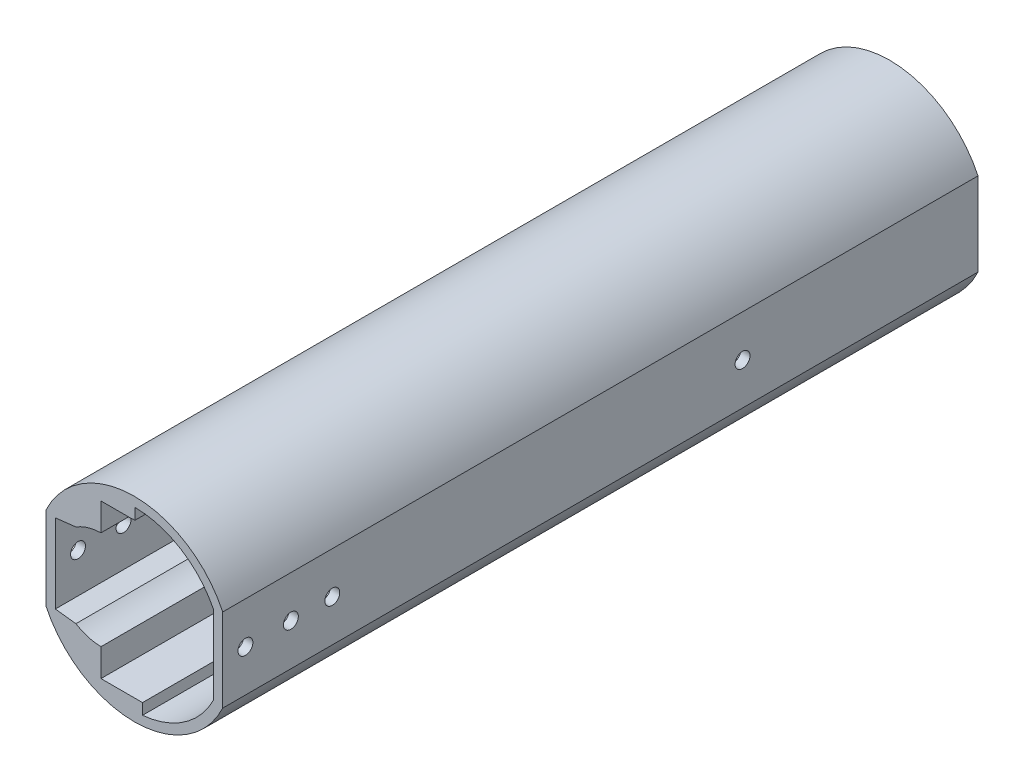
ISO-10303-21;
HEADER;
FILE_DESCRIPTION(('STEP AP214'),'2;1');
FILE_NAME('part.step','',(''),(''),'','','');
FILE_SCHEMA(('AUTOMOTIVE_DESIGN { 1 0 10303 214 1 1 1 1 }'));
ENDSEC;
DATA;
#1=APPLICATION_CONTEXT('core data for automotive mechanical design processes');
#2=APPLICATION_PROTOCOL_DEFINITION('international standard','automotive_design',2000,#1);
#3=PRODUCT_CONTEXT('',#1,'mechanical');
#4=PRODUCT('Part','Part','',(#3));
#5=PRODUCT_RELATED_PRODUCT_CATEGORY('part','',(#4));
#6=PRODUCT_DEFINITION_FORMATION('','',#4);
#7=PRODUCT_DEFINITION_CONTEXT('part definition',#1,'design');
#8=PRODUCT_DEFINITION('design','',#6,#7);
#9=PRODUCT_DEFINITION_SHAPE('','',#8);
#10=(LENGTH_UNIT() NAMED_UNIT(*) SI_UNIT(.MILLI.,.METRE.));
#11=(NAMED_UNIT(*) PLANE_ANGLE_UNIT() SI_UNIT($,.RADIAN.));
#12=(NAMED_UNIT(*) SI_UNIT($,.STERADIAN.) SOLID_ANGLE_UNIT());
#13=UNCERTAINTY_MEASURE_WITH_UNIT(LENGTH_MEASURE(1.E-05),#10,'distance_accuracy_value','');
#14=(GEOMETRIC_REPRESENTATION_CONTEXT(3) GLOBAL_UNCERTAINTY_ASSIGNED_CONTEXT((#13)) GLOBAL_UNIT_ASSIGNED_CONTEXT((#10,
#11,#12)) REPRESENTATION_CONTEXT('',''));
#15=CARTESIAN_POINT('',(0.,0.,0.));
#16=DIRECTION('',(0.,0.,1.));
#17=DIRECTION('',(1.,0.,0.));
#18=AXIS2_PLACEMENT_3D('',#15,#16,#17);
#19=CARTESIAN_POINT('',(-1.74996172605003,-0.0491266672354965,-140.));
#20=DIRECTION('',(0.,0.,-1.));
#21=DIRECTION('',(-1.,0.,0.));
#22=AXIS2_PLACEMENT_3D('',#19,#20,#21);
#23=PLANE('',#22);
#24=CARTESIAN_POINT('',(-1.59999999999996,-8.70722550504569,-140.));
#25=DIRECTION('',(0.,0.,-1.));
#26=DIRECTION('',(-1.,0.,0.));
#27=AXIS2_PLACEMENT_3D('',#24,#25,#26);
#28=CIRCLE('',#27,6.2);
#29=CARTESIAN_POINT('',(-7.79999999999996,-8.70722550504569,-140.));
#30=VERTEX_POINT('',#29);
#31=EDGE_CURVE('E180',#30,#30,#28,.F.);
#32=ORIENTED_EDGE('',*,*,#31,.F.);
#33=EDGE_LOOP('',(#32));
#34=FACE_BOUND('',#33,.T.);
#35=DIRECTION('',(0.,1.,0.));
#36=VECTOR('',#35,1.);
#37=CARTESIAN_POINT('',(-1.6,16.45,-140.));
#38=LINE('',#37,#36);
#39=CARTESIAN_POINT('',(-1.6,16.5251,-140.));
#40=VERTEX_POINT('',#39);
#41=CARTESIAN_POINT('',(-1.6,18.9002416837012,-140.));
#42=VERTEX_POINT('',#41);
#43=EDGE_CURVE('E328',#40,#42,#38,.T.);
#44=ORIENTED_EDGE('',*,*,#43,.F.);
#45=CARTESIAN_POINT('',(-1.59999999999996,10.3251,-140.));
#46=DIRECTION('',(0.,0.,-1.));
#47=DIRECTION('',(-1.,0.,0.));
#48=AXIS2_PLACEMENT_3D('',#45,#46,#47);
#49=CIRCLE('',#48,6.2);
#50=CARTESIAN_POINT('',(-2.56208107246732,16.45,-140.));
#51=VERTEX_POINT('',#50);
#52=EDGE_CURVE('E284',#40,#51,#49,.T.);
#53=ORIENTED_EDGE('',*,*,#52,.T.);
#54=DIRECTION('',(1.,0.,0.));
#55=VECTOR('',#54,1.);
#56=CARTESIAN_POINT('',(-8.91199999971296,16.45,-140.));
#57=LINE('',#56,#55);
#58=CARTESIAN_POINT('',(-8.91199999971296,16.45,-140.));
#59=VERTEX_POINT('',#58);
#60=EDGE_CURVE('E189',#59,#51,#57,.T.);
#61=ORIENTED_EDGE('',*,*,#60,.F.);
#62=DIRECTION('',(0.,1.,0.));
#63=VECTOR('',#62,1.);
#64=CARTESIAN_POINT('',(-8.91199999971296,10.5231996089647,-140.));
#65=LINE('',#64,#63);
#66=CARTESIAN_POINT('',(-8.91199999971296,10.5231996089647,-140.));
#67=VERTEX_POINT('',#66);
#68=EDGE_CURVE('E324',#67,#59,#65,.T.);
#69=ORIENTED_EDGE('',*,*,#68,.F.);
#70=CARTESIAN_POINT('',(-8.71200000000002,0.,-140.));
#71=DIRECTION('',(0.,0.,-1.));
#72=DIRECTION('',(-1.,0.,0.));
#73=AXIS2_PLACEMENT_3D('',#70,#71,#72);
#74=CIRCLE('',#73,10.5251);
#75=CARTESIAN_POINT('',(-14.2787810578106,8.9324508766856,-140.));
#76=VERTEX_POINT('',#75);
#77=EDGE_CURVE('E321',#76,#67,#74,.T.);
#78=ORIENTED_EDGE('',*,*,#77,.F.);
#79=DIRECTION('',(0.993460859770838,0.1141732022122,0.));
#80=VECTOR('',#79,1.);
#81=CARTESIAN_POINT('',(-18.6999234521001,8.42435236467318,-140.));
#82=LINE('',#81,#80);
#83=CARTESIAN_POINT('',(-18.6999234521001,8.42435236467318,-140.));
#84=VERTEX_POINT('',#83);
#85=EDGE_CURVE('E318',#84,#76,#82,.T.);
#86=ORIENTED_EDGE('',*,*,#85,.F.);
#87=DIRECTION('',(0.,1.,0.));
#88=VECTOR('',#87,1.);
#89=CARTESIAN_POINT('',(-18.6999234520998,-8.52260569914465,-140.));
#90=LINE('',#89,#88);
#91=CARTESIAN_POINT('',(-18.6999234520998,-8.52260569914465,-140.));
#92=VERTEX_POINT('',#91);
#93=EDGE_CURVE('E315',#92,#84,#90,.T.);
#94=ORIENTED_EDGE('',*,*,#93,.F.);
#95=DIRECTION('',(-0.993460859770849,0.114173202212101,0.));
#96=VECTOR('',#95,1.);
#97=CARTESIAN_POINT('',(-14.2787810578106,-9.03070421115659,-140.));
#98=LINE('',#97,#96);
#99=CARTESIAN_POINT('',(-14.2787810578106,-9.03070421115659,-140.));
#100=VERTEX_POINT('',#99);
#101=EDGE_CURVE('E313',#100,#92,#98,.T.);
#102=ORIENTED_EDGE('',*,*,#101,.F.);
#103=CARTESIAN_POINT('',(-8.71200000000002,-0.0982533344709912,-140.));
#104=DIRECTION('',(0.,0.,-1.));
#105=DIRECTION('',(-1.,0.,0.));
#106=AXIS2_PLACEMENT_3D('',#103,#104,#105);
#107=CIRCLE('',#106,10.5251);
#108=CARTESIAN_POINT('',(-8.91199999971296,-10.6214529434357,-140.));
#109=VERTEX_POINT('',#108);
#110=EDGE_CURVE('E310',#109,#100,#107,.T.);
#111=ORIENTED_EDGE('',*,*,#110,.F.);
#112=DIRECTION('',(0.,1.,0.));
#113=VECTOR('',#112,1.);
#114=CARTESIAN_POINT('',(-8.91199999971296,-16.548253334471,-140.));
#115=LINE('',#114,#113);
#116=CARTESIAN_POINT('',(-8.91199999971296,-16.548253334471,-140.));
#117=VERTEX_POINT('',#116);
#118=EDGE_CURVE('E307',#117,#109,#115,.T.);
#119=ORIENTED_EDGE('',*,*,#118,.F.);
#120=DIRECTION('',(-1.,0.,0.));
#121=VECTOR('',#120,1.);
#122=CARTESIAN_POINT('',(0.,-16.548253334471,-140.));
#123=LINE('',#122,#121);
#124=CARTESIAN_POINT('',(0.,-16.548253334471,-140.));
#125=VERTEX_POINT('',#124);
#126=EDGE_CURVE('E304',#125,#117,#123,.T.);
#127=ORIENTED_EDGE('',*,*,#126,.F.);
#128=DIRECTION('',(0.,1.,0.));
#129=VECTOR('',#128,1.);
#130=CARTESIAN_POINT('',(0.,-18.91811401092,-140.));
#131=LINE('',#130,#129);
#132=CARTESIAN_POINT('',(0.,-18.91811401092,-140.));
#133=VERTEX_POINT('',#132);
#134=EDGE_CURVE('E301',#133,#125,#131,.T.);
#135=ORIENTED_EDGE('',*,*,#134,.F.);
#136=CARTESIAN_POINT('',(-1.74996172605003,-0.0491266672354965,-140.));
#137=DIRECTION('',(0.,0.,-1.));
#138=DIRECTION('',(-1.,0.,0.));
#139=AXIS2_PLACEMENT_3D('',#136,#137,#138);
#140=CIRCLE('',#139,18.9499617260504);
#141=CARTESIAN_POINT('',(15.2000000000004,-8.52260569914462,-140.));
#142=VERTEX_POINT('',#141);
#143=EDGE_CURVE('E298',#142,#133,#140,.T.);
#144=ORIENTED_EDGE('',*,*,#143,.F.);
#145=DIRECTION('',(0.,-1.,0.));
#146=VECTOR('',#145,1.);
#147=CARTESIAN_POINT('',(15.1999999999999,8.42435236467339,-140.));
#148=LINE('',#147,#146);
#149=CARTESIAN_POINT('',(15.1999999999999,8.42435236467339,-140.));
#150=VERTEX_POINT('',#149);
#151=EDGE_CURVE('E333',#150,#142,#148,.T.);
#152=ORIENTED_EDGE('',*,*,#151,.F.);
#153=CARTESIAN_POINT('',(-1.74996172605003,-0.0491266672354965,-140.));
#154=DIRECTION('',(0.,0.,-1.));
#155=DIRECTION('',(-1.,0.,0.));
#156=AXIS2_PLACEMENT_3D('',#153,#154,#155);
#157=CIRCLE('',#156,18.94996172605);
#158=EDGE_CURVE('E330',#42,#150,#157,.T.);
#159=ORIENTED_EDGE('',*,*,#158,.F.);
#160=EDGE_LOOP('',(#44,#53,#61,#69,#78,#86,#94,#102,#111,#119,#127,#135,#144,#152,#159));
#161=FACE_BOUND('',#160,.T.);
#162=ADVANCED_FACE('F40',(#34,#161),#23,.F.);
#163=CARTESIAN_POINT('',(-1.74996172605003,-0.0491266672354965,-142.));
#164=DIRECTION('',(0.,0.,-1.));
#165=DIRECTION('',(-1.,0.,0.));
#166=AXIS2_PLACEMENT_3D('',#163,#164,#165);
#167=PLANE('',#166);
#168=CARTESIAN_POINT('',(-1.59999999999996,-8.70722550504569,-142.));
#169=DIRECTION('',(0.,0.,-1.));
#170=DIRECTION('',(-1.,0.,0.));
#171=AXIS2_PLACEMENT_3D('',#168,#169,#170);
#172=CIRCLE('',#171,6.2);
#173=CARTESIAN_POINT('',(-7.79999999999996,-8.70722550504569,-142.));
#174=VERTEX_POINT('',#173);
#175=EDGE_CURVE('E276',#174,#174,#172,.F.);
#176=ORIENTED_EDGE('',*,*,#175,.T.);
#177=EDGE_LOOP('',(#176));
#178=FACE_BOUND('',#177,.T.);
#179=CARTESIAN_POINT('',(-1.74996172605003,-0.0491266672354965,-142.));
#180=DIRECTION('',(0.,0.,-1.));
#181=DIRECTION('',(-1.,0.,0.));
#182=AXIS2_PLACEMENT_3D('',#179,#180,#181);
#183=CIRCLE('',#182,20.9499617260503);
#184=CARTESIAN_POINT('',(17.2000000000003,-8.9822026718491,-142.));
#185=VERTEX_POINT('',#184);
#186=CARTESIAN_POINT('',(-20.6999234521002,-8.98220267184937,-142.));
#187=VERTEX_POINT('',#186);
#188=EDGE_CURVE('E190',#185,#187,#183,.T.);
#189=ORIENTED_EDGE('',*,*,#188,.T.);
#190=DIRECTION('',(0.,1.,0.));
#191=VECTOR('',#190,1.);
#192=CARTESIAN_POINT('',(-20.6999234521002,-8.98220267184937,-142.));
#193=LINE('',#192,#191);
#194=CARTESIAN_POINT('',(-20.6999234521002,8.88394933737773,-142.));
#195=VERTEX_POINT('',#194);
#196=EDGE_CURVE('E289',#187,#195,#193,.T.);
#197=ORIENTED_EDGE('',*,*,#196,.T.);
#198=CARTESIAN_POINT('',(-1.74996172605003,-0.0491266672354965,-142.));
#199=DIRECTION('',(0.,0.,-1.));
#200=DIRECTION('',(-1.,0.,0.));
#201=AXIS2_PLACEMENT_3D('',#198,#199,#200);
#202=CIRCLE('',#201,20.9499617260501);
#203=CARTESIAN_POINT('',(17.2000000000003,8.88394933737758,-142.));
#204=VERTEX_POINT('',#203);
#205=EDGE_CURVE('E292',#195,#204,#202,.T.);
#206=ORIENTED_EDGE('',*,*,#205,.T.);
#207=DIRECTION('',(0.,-1.,0.));
#208=VECTOR('',#207,1.);
#209=CARTESIAN_POINT('',(17.2000000000003,8.88394933737758,-142.));
#210=LINE('',#209,#208);
#211=EDGE_CURVE('E295',#204,#185,#210,.T.);
#212=ORIENTED_EDGE('',*,*,#211,.T.);
#213=EDGE_LOOP('',(#189,#197,#206,#212));
#214=FACE_BOUND('',#213,.T.);
#215=CARTESIAN_POINT('',(-1.59999999999996,10.3251,-142.));
#216=DIRECTION('',(0.,0.,-1.));
#217=DIRECTION('',(-1.,0.,0.));
#218=AXIS2_PLACEMENT_3D('',#215,#216,#217);
#219=CIRCLE('',#218,6.2);
#220=CARTESIAN_POINT('',(-7.79999999999996,10.3251,-142.));
#221=VERTEX_POINT('',#220);
#222=EDGE_CURVE('E181',#221,#221,#219,.T.);
#223=ORIENTED_EDGE('',*,*,#222,.F.);
#224=EDGE_LOOP('',(#223));
#225=FACE_BOUND('',#224,.T.);
#226=ADVANCED_FACE('F414',(#178,#214,#225),#167,.T.);
#227=CARTESIAN_POINT('',(0.,16.45,-95.));
#228=DIRECTION('',(0.,1.,0.));
#229=DIRECTION('',(0.,0.,1.));
#230=AXIS2_PLACEMENT_3D('',#227,#228,#229);
#231=PLANE('',#230);
#232=ORIENTED_EDGE('',*,*,#60,.T.);
#233=DIRECTION('',(0.,0.,-1.));
#234=VECTOR('',#233,1.);
#235=CARTESIAN_POINT('',(-2.56208107246732,16.45,20.));
#236=LINE('',#235,#234);
#237=CARTESIAN_POINT('',(-2.56208107246732,16.45,20.));
#238=VERTEX_POINT('',#237);
#239=EDGE_CURVE('E57',#51,#238,#236,.F.);
#240=ORIENTED_EDGE('',*,*,#239,.T.);
#241=DIRECTION('',(-1.,0.,0.));
#242=VECTOR('',#241,1.);
#243=CARTESIAN_POINT('',(-1.6,16.45,20.));
#244=LINE('',#243,#242);
#245=CARTESIAN_POINT('',(-8.91199999971296,16.45,20.));
#246=VERTEX_POINT('',#245);
#247=EDGE_CURVE('E187',#238,#246,#244,.T.);
#248=ORIENTED_EDGE('',*,*,#247,.T.);
#249=DIRECTION('',(0.,0.,1.));
#250=VECTOR('',#249,1.);
#251=CARTESIAN_POINT('',(-8.91199999971296,16.45,-95.));
#252=LINE('',#251,#250);
#253=EDGE_CURVE('E243',#59,#246,#252,.T.);
#254=ORIENTED_EDGE('',*,*,#253,.F.);
#255=EDGE_LOOP('',(#232,#240,#248,#254));
#256=FACE_BOUND('',#255,.T.);
#257=ADVANCED_FACE('F185',(#256),#231,.F.);
#258=CARTESIAN_POINT('',(-1.74996172605003,-0.0491266672354965,-151.497856445771));
#259=DIRECTION('',(0.,0.,1.));
#260=DIRECTION('',(1.,0.,0.));
#261=AXIS2_PLACEMENT_3D('',#258,#259,#260);
#262=CYLINDRICAL_SURFACE('',#261,18.9499617260502);
#263=DIRECTION('',(0.,0.,1.));
#264=VECTOR('',#263,1.);
#265=CARTESIAN_POINT('',(15.2000000000004,-8.52260569914462,-151.497856445771));
#266=LINE('',#265,#264);
#267=CARTESIAN_POINT('',(15.2000000000004,-8.52260569914462,20.));
#268=VERTEX_POINT('',#267);
#269=EDGE_CURVE('E251',#142,#268,#266,.T.);
#270=ORIENTED_EDGE('',*,*,#269,.F.);
#271=ORIENTED_EDGE('',*,*,#143,.T.);
#272=DIRECTION('',(0.,0.,1.));
#273=VECTOR('',#272,1.);
#274=CARTESIAN_POINT('',(0.,-18.91811401092,-95.));
#275=LINE('',#274,#273);
#276=CARTESIAN_POINT('',(0.,-18.9181140109203,20.));
#277=VERTEX_POINT('',#276);
#278=EDGE_CURVE('E231',#133,#277,#275,.T.);
#279=ORIENTED_EDGE('',*,*,#278,.T.);
#280=CARTESIAN_POINT('',(-1.74996172605003,-0.0491266672354965,20.));
#281=DIRECTION('',(0.,0.,1.));
#282=DIRECTION('',(1.,0.,0.));
#283=AXIS2_PLACEMENT_3D('',#280,#281,#282);
#284=CIRCLE('',#283,18.9499617260504);
#285=EDGE_CURVE('E348',#277,#268,#284,.T.);
#286=ORIENTED_EDGE('',*,*,#285,.T.);
#287=EDGE_LOOP('',(#270,#271,#279,#286));
#288=FACE_BOUND('',#287,.T.);
#289=ADVANCED_FACE('F372',(#288),#262,.F.);
#290=CARTESIAN_POINT('',(-1.74996172605003,-0.0491266672354965,-151.497856445771));
#291=DIRECTION('',(0.,0.,1.));
#292=DIRECTION('',(1.,0.,0.));
#293=AXIS2_PLACEMENT_3D('',#290,#291,#292);
#294=CYLINDRICAL_SURFACE('',#293,18.94996172605);
#295=DIRECTION('',(0.,0.,1.));
#296=VECTOR('',#295,1.);
#297=CARTESIAN_POINT('',(15.2,8.42435236467342,-151.497856445771));
#298=LINE('',#297,#296);
#299=CARTESIAN_POINT('',(15.2,8.42435236467344,20.));
#300=VERTEX_POINT('',#299);
#301=EDGE_CURVE('E253',#150,#300,#298,.T.);
#302=ORIENTED_EDGE('',*,*,#301,.T.);
#303=CARTESIAN_POINT('',(-1.74996172605003,-0.0491266672354965,20.));
#304=DIRECTION('',(0.,0.,1.));
#305=DIRECTION('',(1.,0.,0.));
#306=AXIS2_PLACEMENT_3D('',#303,#304,#305);
#307=CIRCLE('',#306,18.9499617260501);
#308=CARTESIAN_POINT('',(-1.6,18.9002416837013,20.));
#309=VERTEX_POINT('',#308);
#310=EDGE_CURVE('E202',#300,#309,#307,.T.);
#311=ORIENTED_EDGE('',*,*,#310,.T.);
#312=DIRECTION('',(0.,0.,1.));
#313=VECTOR('',#312,1.);
#314=CARTESIAN_POINT('',(-1.6,18.9002416837013,-95.));
#315=LINE('',#314,#313);
#316=EDGE_CURVE('E227',#42,#309,#315,.T.);
#317=ORIENTED_EDGE('',*,*,#316,.F.);
#318=ORIENTED_EDGE('',*,*,#158,.T.);
#319=EDGE_LOOP('',(#302,#311,#317,#318));
#320=FACE_BOUND('',#319,.T.);
#321=ADVANCED_FACE('F357',(#320),#294,.F.);
#322=CARTESIAN_POINT('',(-20.6999234520999,-2.89421281809422E-13,-151.497856445771));
#323=DIRECTION('',(-1.,0.,0.));
#324=DIRECTION('',(0.,-1.,0.));
#325=AXIS2_PLACEMENT_3D('',#322,#323,#324);
#326=PLANE('',#325);
#327=CARTESIAN_POINT('',(-20.6999234521002,-0.024563333617532,15.125));
#328=DIRECTION('',(1.,0.,0.));
#329=DIRECTION('',(0.,0.,-1.));
#330=AXIS2_PLACEMENT_3D('',#327,#328,#329);
#331=CIRCLE('',#330,1.6);
#332=CARTESIAN_POINT('',(-20.6999234521002,-0.024563333617532,13.525));
#333=VERTEX_POINT('',#332);
#334=EDGE_CURVE('E270',#333,#333,#331,.T.);
#335=ORIENTED_EDGE('',*,*,#334,.T.);
#336=EDGE_LOOP('',(#335));
#337=FACE_BOUND('',#336,.T.);
#338=CARTESIAN_POINT('',(-20.6999234521002,-0.0491266672352679,5.375));
#339=DIRECTION('',(1.,0.,0.));
#340=DIRECTION('',(0.,0.,-1.));
#341=AXIS2_PLACEMENT_3D('',#338,#339,#340);
#342=CIRCLE('',#341,1.6);
#343=CARTESIAN_POINT('',(-20.6999234521002,-0.0491266672352679,3.775));
#344=VERTEX_POINT('',#343);
#345=EDGE_CURVE('E909',#344,#344,#342,.T.);
#346=ORIENTED_EDGE('',*,*,#345,.T.);
#347=EDGE_LOOP('',(#346));
#348=FACE_BOUND('',#347,.T.);
#349=DIRECTION('',(0.,0.,1.));
#350=VECTOR('',#349,1.);
#351=CARTESIAN_POINT('',(-20.6999234521001,8.88394933737765,-151.497856445771));
#352=LINE('',#351,#350);
#353=CARTESIAN_POINT('',(-20.6999234521001,8.88394933737765,20.));
#354=VERTEX_POINT('',#353);
#355=EDGE_CURVE('E246',#195,#354,#352,.T.);
#356=ORIENTED_EDGE('',*,*,#355,.F.);
#357=ORIENTED_EDGE('',*,*,#196,.F.);
#358=DIRECTION('',(0.,0.,1.));
#359=VECTOR('',#358,1.);
#360=CARTESIAN_POINT('',(-20.6999234520998,-8.98220267184917,-151.497856445771));
#361=LINE('',#360,#359);
#362=CARTESIAN_POINT('',(-20.6999234520998,-8.98220267184917,20.));
#363=VERTEX_POINT('',#362);
#364=EDGE_CURVE('E242',#187,#363,#361,.T.);
#365=ORIENTED_EDGE('',*,*,#364,.T.);
#366=DIRECTION('',(0.,-1.,0.));
#367=VECTOR('',#366,1.);
#368=CARTESIAN_POINT('',(-20.6999234521001,8.88394933737765,20.));
#369=LINE('',#368,#367);
#370=EDGE_CURVE('E218',#354,#363,#369,.T.);
#371=ORIENTED_EDGE('',*,*,#370,.F.);
#372=EDGE_LOOP('',(#356,#357,#365,#371));
#373=FACE_BOUND('',#372,.T.);
#374=ADVANCED_FACE('F42',(#337,#348,#373),#326,.T.);
#375=CARTESIAN_POINT('',(-1.74996172605003,-0.0491266672354965,-151.497856445771));
#376=DIRECTION('',(0.,0.,1.));
#377=DIRECTION('',(1.,0.,0.));
#378=AXIS2_PLACEMENT_3D('',#375,#376,#377);
#379=CYLINDRICAL_SURFACE('',#378,20.9499617260501);
#380=DIRECTION('',(0.,0.,1.));
#381=VECTOR('',#380,1.);
#382=CARTESIAN_POINT('',(17.2000000000004,8.88394933737765,-151.497856445771));
#383=LINE('',#382,#381);
#384=CARTESIAN_POINT('',(17.2000000000004,8.88394933737765,20.));
#385=VERTEX_POINT('',#384);
#386=EDGE_CURVE('E248',#204,#385,#383,.T.);
#387=ORIENTED_EDGE('',*,*,#386,.F.);
#388=ORIENTED_EDGE('',*,*,#205,.F.);
#389=ORIENTED_EDGE('',*,*,#355,.T.);
#390=CARTESIAN_POINT('',(-1.74996172605003,-0.0491266672354965,20.));
#391=DIRECTION('',(0.,0.,1.));
#392=DIRECTION('',(1.,0.,0.));
#393=AXIS2_PLACEMENT_3D('',#390,#391,#392);
#394=CIRCLE('',#393,20.9499617260501);
#395=EDGE_CURVE('E215',#385,#354,#394,.T.);
#396=ORIENTED_EDGE('',*,*,#395,.F.);
#397=EDGE_LOOP('',(#387,#388,#389,#396));
#398=FACE_BOUND('',#397,.T.);
#399=ADVANCED_FACE('F454',(#398),#379,.T.);
#400=CARTESIAN_POINT('',(17.2000000000004,0.,-151.497856445771));
#401=DIRECTION('',(-1.,0.,0.));
#402=DIRECTION('',(0.,0.,1.));
#403=AXIS2_PLACEMENT_3D('',#400,#401,#402);
#404=PLANE('',#403);
#405=CARTESIAN_POINT('',(17.2000000000004,-0.024563333617532,15.125));
#406=DIRECTION('',(1.,0.,0.));
#407=DIRECTION('',(0.,0.,-1.));
#408=AXIS2_PLACEMENT_3D('',#405,#406,#407);
#409=CIRCLE('',#408,1.6);
#410=CARTESIAN_POINT('',(17.2000000000004,-0.024563333617532,13.525));
#411=VERTEX_POINT('',#410);
#412=EDGE_CURVE('E912',#411,#411,#409,.T.);
#413=ORIENTED_EDGE('',*,*,#412,.F.);
#414=EDGE_LOOP('',(#413));
#415=FACE_BOUND('',#414,.T.);
#416=CARTESIAN_POINT('',(17.2000000000004,-0.0491266672352679,5.375));
#417=DIRECTION('',(1.,0.,0.));
#418=DIRECTION('',(0.,0.,-1.));
#419=AXIS2_PLACEMENT_3D('',#416,#417,#418);
#420=CIRCLE('',#419,1.6);
#421=CARTESIAN_POINT('',(17.2000000000004,-0.0491266672352679,3.775));
#422=VERTEX_POINT('',#421);
#423=EDGE_CURVE('E904',#422,#422,#420,.T.);
#424=ORIENTED_EDGE('',*,*,#423,.F.);
#425=EDGE_LOOP('',(#424));
#426=FACE_BOUND('',#425,.T.);
#427=CARTESIAN_POINT('',(17.2000000000004,-0.049126667235695,-3.5));
#428=DIRECTION('',(1.,0.,0.));
#429=DIRECTION('',(0.,0.,-1.));
#430=AXIS2_PLACEMENT_3D('',#427,#428,#429);
#431=CIRCLE('',#430,1.6);
#432=CARTESIAN_POINT('',(17.2000000000004,-0.049126667235695,-5.1));
#433=VERTEX_POINT('',#432);
#434=EDGE_CURVE('E902',#433,#433,#431,.T.);
#435=ORIENTED_EDGE('',*,*,#434,.F.);
#436=EDGE_LOOP('',(#435));
#437=FACE_BOUND('',#436,.T.);
#438=CARTESIAN_POINT('',(17.2000000000004,-0.0491266672356838,-91.5));
#439=DIRECTION('',(1.,0.,0.));
#440=DIRECTION('',(0.,0.,-1.));
#441=AXIS2_PLACEMENT_3D('',#438,#439,#440);
#442=CIRCLE('',#441,1.60000000000001);
#443=CARTESIAN_POINT('',(17.2000000000004,-0.0491266672356838,-93.1));
#444=VERTEX_POINT('',#443);
#445=EDGE_CURVE('E900',#444,#444,#442,.T.);
#446=ORIENTED_EDGE('',*,*,#445,.F.);
#447=EDGE_LOOP('',(#446));
#448=FACE_BOUND('',#447,.T.);
#449=DIRECTION('',(0.,0.,1.));
#450=VECTOR('',#449,1.);
#451=CARTESIAN_POINT('',(17.2000000000004,-8.98220267184917,-151.497856445771));
#452=LINE('',#451,#450);
#453=CARTESIAN_POINT('',(17.2,-8.98220267184899,20.));
#454=VERTEX_POINT('',#453);
#455=EDGE_CURVE('E11',#185,#454,#452,.T.);
#456=ORIENTED_EDGE('',*,*,#455,.F.);
#457=ORIENTED_EDGE('',*,*,#211,.F.);
#458=ORIENTED_EDGE('',*,*,#386,.T.);
#459=DIRECTION('',(0.,1.,0.));
#460=VECTOR('',#459,1.);
#461=CARTESIAN_POINT('',(17.2000000000001,-8.98220267184905,20.));
#462=LINE('',#461,#460);
#463=EDGE_CURVE('E224',#454,#385,#462,.T.);
#464=ORIENTED_EDGE('',*,*,#463,.F.);
#465=EDGE_LOOP('',(#456,#457,#458,#464));
#466=FACE_BOUND('',#465,.T.);
#467=ADVANCED_FACE('F452',(#415,#426,#437,#448,#466),#404,.F.);
#468=CARTESIAN_POINT('',(15.2000000000002,3.7652815390254E-13,-151.497856445771));
#469=DIRECTION('',(-1.,0.,0.));
#470=DIRECTION('',(0.,-1.,0.));
#471=AXIS2_PLACEMENT_3D('',#468,#469,#470);
#472=PLANE('',#471);
#473=CARTESIAN_POINT('',(15.2000000000002,-0.024563333617532,15.125));
#474=DIRECTION('',(-1.,0.,0.));
#475=DIRECTION('',(0.,-1.,0.));
#476=AXIS2_PLACEMENT_3D('',#473,#474,#475);
#477=CIRCLE('',#476,1.6);
#478=CARTESIAN_POINT('',(15.2000000000002,-1.62456333361753,15.125));
#479=VERTEX_POINT('',#478);
#480=EDGE_CURVE('E274',#479,#479,#477,.T.);
#481=ORIENTED_EDGE('',*,*,#480,.F.);
#482=EDGE_LOOP('',(#481));
#483=FACE_BOUND('',#482,.T.);
#484=CARTESIAN_POINT('',(15.2000000000002,-0.0491266672352679,5.375));
#485=DIRECTION('',(-1.,0.,0.));
#486=DIRECTION('',(0.,-1.,0.));
#487=AXIS2_PLACEMENT_3D('',#484,#485,#486);
#488=CIRCLE('',#487,1.6);
#489=CARTESIAN_POINT('',(15.2000000000002,-1.64912666723527,5.375));
#490=VERTEX_POINT('',#489);
#491=EDGE_CURVE('E258',#490,#490,#488,.T.);
#492=ORIENTED_EDGE('',*,*,#491,.F.);
#493=EDGE_LOOP('',(#492));
#494=FACE_BOUND('',#493,.T.);
#495=CARTESIAN_POINT('',(15.2000000000002,-0.049126667235695,-3.5));
#496=DIRECTION('',(-1.,0.,0.));
#497=DIRECTION('',(0.,-1.,0.));
#498=AXIS2_PLACEMENT_3D('',#495,#496,#497);
#499=CIRCLE('',#498,1.6);
#500=CARTESIAN_POINT('',(15.2000000000002,-1.6491266672357,-3.5));
#501=VERTEX_POINT('',#500);
#502=EDGE_CURVE('E259',#501,#501,#499,.T.);
#503=ORIENTED_EDGE('',*,*,#502,.F.);
#504=EDGE_LOOP('',(#503));
#505=FACE_BOUND('',#504,.T.);
#506=CARTESIAN_POINT('',(15.2000000000002,-0.0491266672356838,-91.5));
#507=DIRECTION('',(-1.,0.,0.));
#508=DIRECTION('',(0.,-1.,0.));
#509=AXIS2_PLACEMENT_3D('',#506,#507,#508);
#510=CIRCLE('',#509,1.60000000000001);
#511=CARTESIAN_POINT('',(15.2000000000002,-1.64912666723569,-91.5));
#512=VERTEX_POINT('',#511);
#513=EDGE_CURVE('E265',#512,#512,#510,.T.);
#514=ORIENTED_EDGE('',*,*,#513,.F.);
#515=EDGE_LOOP('',(#514));
#516=FACE_BOUND('',#515,.T.);
#517=ORIENTED_EDGE('',*,*,#301,.F.);
#518=ORIENTED_EDGE('',*,*,#151,.T.);
#519=ORIENTED_EDGE('',*,*,#269,.T.);
#520=DIRECTION('',(0.,1.,0.));
#521=VECTOR('',#520,1.);
#522=CARTESIAN_POINT('',(15.2000000000004,-8.52260569914462,20.));
#523=LINE('',#522,#521);
#524=EDGE_CURVE('E351',#268,#300,#523,.T.);
#525=ORIENTED_EDGE('',*,*,#524,.T.);
#526=EDGE_LOOP('',(#517,#518,#519,#525));
#527=FACE_BOUND('',#526,.T.);
#528=ADVANCED_FACE('F367',(#483,#494,#505,#516,#527),#472,.T.);
#529=CARTESIAN_POINT('',(-18.6999234520999,-2.60325815885485E-13,-151.497856445771));
#530=DIRECTION('',(-1.,0.,0.));
#531=DIRECTION('',(0.,-1.,0.));
#532=AXIS2_PLACEMENT_3D('',#529,#530,#531);
#533=PLANE('',#532);
#534=CARTESIAN_POINT('',(-18.6999234520999,-0.024563333617532,15.125));
#535=DIRECTION('',(-1.,0.,0.));
#536=DIRECTION('',(0.,-1.,0.));
#537=AXIS2_PLACEMENT_3D('',#534,#535,#536);
#538=CIRCLE('',#537,1.6);
#539=CARTESIAN_POINT('',(-18.6999234520999,-1.62456333361753,15.125));
#540=VERTEX_POINT('',#539);
#541=EDGE_CURVE('E44',#540,#540,#538,.T.);
#542=ORIENTED_EDGE('',*,*,#541,.T.);
#543=EDGE_LOOP('',(#542));
#544=FACE_BOUND('',#543,.T.);
#545=CARTESIAN_POINT('',(-18.6999234520999,-0.0491266672352679,5.375));
#546=DIRECTION('',(-1.,0.,0.));
#547=DIRECTION('',(0.,-1.,0.));
#548=AXIS2_PLACEMENT_3D('',#545,#546,#547);
#549=CIRCLE('',#548,1.6);
#550=CARTESIAN_POINT('',(-18.6999234520999,-1.64912666723527,5.375));
#551=VERTEX_POINT('',#550);
#552=EDGE_CURVE('E256',#551,#551,#549,.T.);
#553=ORIENTED_EDGE('',*,*,#552,.T.);
#554=EDGE_LOOP('',(#553));
#555=FACE_BOUND('',#554,.T.);
#556=DIRECTION('',(0.,0.,1.));
#557=VECTOR('',#556,1.);
#558=CARTESIAN_POINT('',(-18.6999234520998,-8.52260569914465,-151.497856445771));
#559=LINE('',#558,#557);
#560=CARTESIAN_POINT('',(-18.6999234520998,-8.52260569914465,20.));
#561=VERTEX_POINT('',#560);
#562=EDGE_CURVE('E65',#92,#561,#559,.T.);
#563=ORIENTED_EDGE('',*,*,#562,.F.);
#564=ORIENTED_EDGE('',*,*,#93,.T.);
#565=DIRECTION('',(0.,0.,1.));
#566=VECTOR('',#565,1.);
#567=CARTESIAN_POINT('',(-18.6999234521001,8.42435236467318,-151.497856445771));
#568=LINE('',#567,#566);
#569=CARTESIAN_POINT('',(-18.6999234521001,8.42435236467318,20.));
#570=VERTEX_POINT('',#569);
#571=EDGE_CURVE('E49',#84,#570,#568,.T.);
#572=ORIENTED_EDGE('',*,*,#571,.T.);
#573=DIRECTION('',(0.,-1.,0.));
#574=VECTOR('',#573,1.);
#575=CARTESIAN_POINT('',(-18.6999234521001,8.42435236467318,20.));
#576=LINE('',#575,#574);
#577=EDGE_CURVE('E211',#570,#561,#576,.T.);
#578=ORIENTED_EDGE('',*,*,#577,.T.);
#579=EDGE_LOOP('',(#563,#564,#572,#578));
#580=FACE_BOUND('',#579,.T.);
#581=ADVANCED_FACE('F393',(#544,#555,#580),#533,.F.);
#582=CARTESIAN_POINT('',(-1.74996172605003,-0.0491266672354965,-151.497856445771));
#583=DIRECTION('',(0.,0.,1.));
#584=DIRECTION('',(1.,0.,0.));
#585=AXIS2_PLACEMENT_3D('',#582,#583,#584);
#586=CYLINDRICAL_SURFACE('',#585,20.9499617260502);
#587=ORIENTED_EDGE('',*,*,#364,.F.);
#588=ORIENTED_EDGE('',*,*,#188,.F.);
#589=ORIENTED_EDGE('',*,*,#455,.T.);
#590=CARTESIAN_POINT('',(-1.74996172605003,-0.0491266672354965,20.));
#591=DIRECTION('',(0.,0.,1.));
#592=DIRECTION('',(1.,0.,0.));
#593=AXIS2_PLACEMENT_3D('',#590,#591,#592);
#594=CIRCLE('',#593,20.9499617260501);
#595=EDGE_CURVE('E221',#363,#454,#594,.T.);
#596=ORIENTED_EDGE('',*,*,#595,.F.);
#597=EDGE_LOOP('',(#587,#588,#589,#596));
#598=FACE_BOUND('',#597,.T.);
#599=ADVANCED_FACE('F448',(#598),#586,.T.);
#600=CARTESIAN_POINT('',(-8.71200000000002,0.,-95.));
#601=DIRECTION('',(0.,0.,1.));
#602=DIRECTION('',(1.,0.,0.));
#603=AXIS2_PLACEMENT_3D('',#600,#601,#602);
#604=CYLINDRICAL_SURFACE('',#603,10.5251);
#605=DIRECTION('',(0.,0.,1.));
#606=VECTOR('',#605,1.);
#607=CARTESIAN_POINT('',(-8.91199999971296,10.5231996089647,-95.));
#608=LINE('',#607,#606);
#609=CARTESIAN_POINT('',(-8.91199999971296,10.5231996089647,20.));
#610=VERTEX_POINT('',#609);
#611=EDGE_CURVE('E236',#67,#610,#608,.T.);
#612=ORIENTED_EDGE('',*,*,#611,.T.);
#613=CARTESIAN_POINT('',(-8.71200000000002,0.,20.));
#614=DIRECTION('',(0.,0.,1.));
#615=DIRECTION('',(1.,0.,0.));
#616=AXIS2_PLACEMENT_3D('',#613,#614,#615);
#617=CIRCLE('',#616,10.5251);
#618=CARTESIAN_POINT('',(-14.2787810578106,8.9324508766856,20.));
#619=VERTEX_POINT('',#618);
#620=EDGE_CURVE('E200',#610,#619,#617,.T.);
#621=ORIENTED_EDGE('',*,*,#620,.T.);
#622=DIRECTION('',(0.,0.,1.));
#623=VECTOR('',#622,1.);
#624=CARTESIAN_POINT('',(-14.2787810578106,8.9324508766856,-95.));
#625=LINE('',#624,#623);
#626=EDGE_CURVE('E240',#76,#619,#625,.T.);
#627=ORIENTED_EDGE('',*,*,#626,.F.);
#628=ORIENTED_EDGE('',*,*,#77,.T.);
#629=EDGE_LOOP('',(#612,#621,#627,#628));
#630=FACE_BOUND('',#629,.T.);
#631=ADVANCED_FACE('F399',(#630),#604,.F.);
#632=CARTESIAN_POINT('',(-1.19930893831649,10.4356054302239,-95.));
#633=DIRECTION('',(-0.114173202212112,0.993460859770848,0.));
#634=DIRECTION('',(-0.993460859770848,-0.114173202212112,0.));
#635=AXIS2_PLACEMENT_3D('',#632,#633,#634);
#636=PLANE('',#635);
#637=ORIENTED_EDGE('',*,*,#626,.T.);
#638=DIRECTION('',(-0.993460859770838,-0.1141732022122,0.));
#639=VECTOR('',#638,1.);
#640=CARTESIAN_POINT('',(-14.2787810578106,8.9324508766856,20.));
#641=LINE('',#640,#639);
#642=EDGE_CURVE('E208',#619,#570,#641,.T.);
#643=ORIENTED_EDGE('',*,*,#642,.T.);
#644=ORIENTED_EDGE('',*,*,#571,.F.);
#645=ORIENTED_EDGE('',*,*,#85,.T.);
#646=EDGE_LOOP('',(#637,#643,#644,#645));
#647=FACE_BOUND('',#646,.T.);
#648=ADVANCED_FACE('F396',(#647),#636,.F.);
#649=CARTESIAN_POINT('',(-8.91199999971296,0.,-95.));
#650=DIRECTION('',(-1.,0.,0.));
#651=DIRECTION('',(0.,0.,1.));
#652=AXIS2_PLACEMENT_3D('',#649,#650,#651);
#653=PLANE('',#652);
#654=ORIENTED_EDGE('',*,*,#253,.T.);
#655=DIRECTION('',(0.,-1.,0.));
#656=VECTOR('',#655,1.);
#657=CARTESIAN_POINT('',(-8.91199999971296,16.45,20.));
#658=LINE('',#657,#656);
#659=EDGE_CURVE('E197',#246,#610,#658,.T.);
#660=ORIENTED_EDGE('',*,*,#659,.T.);
#661=ORIENTED_EDGE('',*,*,#611,.F.);
#662=ORIENTED_EDGE('',*,*,#68,.T.);
#663=EDGE_LOOP('',(#654,#660,#661,#662));
#664=FACE_BOUND('',#663,.T.);
#665=ADVANCED_FACE('F402',(#664),#653,.F.);
#666=CARTESIAN_POINT('',(-8.91199999971296,0.,-95.));
#667=DIRECTION('',(-1.,0.,0.));
#668=DIRECTION('',(0.,0.,1.));
#669=AXIS2_PLACEMENT_3D('',#666,#667,#668);
#670=PLANE('',#669);
#671=DIRECTION('',(0.,0.,1.));
#672=VECTOR('',#671,1.);
#673=CARTESIAN_POINT('',(-8.91199999971296,-10.6214529434357,-95.));
#674=LINE('',#673,#672);
#675=CARTESIAN_POINT('',(-8.91199999971296,-10.6214529434357,20.));
#676=VERTEX_POINT('',#675);
#677=EDGE_CURVE('E230',#109,#676,#674,.T.);
#678=ORIENTED_EDGE('',*,*,#677,.T.);
#679=DIRECTION('',(0.,-1.,0.));
#680=VECTOR('',#679,1.);
#681=CARTESIAN_POINT('',(-8.91199999971296,-10.6214529434357,20.));
#682=LINE('',#681,#680);
#683=CARTESIAN_POINT('',(-8.91199999971296,-16.548253334471,20.));
#684=VERTEX_POINT('',#683);
#685=EDGE_CURVE('E339',#676,#684,#682,.T.);
#686=ORIENTED_EDGE('',*,*,#685,.T.);
#687=DIRECTION('',(0.,0.,1.));
#688=VECTOR('',#687,1.);
#689=CARTESIAN_POINT('',(-8.91199999971296,-16.548253334471,-95.));
#690=LINE('',#689,#688);
#691=EDGE_CURVE('E234',#117,#684,#690,.T.);
#692=ORIENTED_EDGE('',*,*,#691,.F.);
#693=ORIENTED_EDGE('',*,*,#118,.T.);
#694=EDGE_LOOP('',(#678,#686,#692,#693));
#695=FACE_BOUND('',#694,.T.);
#696=ADVANCED_FACE('F384',(#695),#670,.F.);
#697=CARTESIAN_POINT('',(0.,-16.548253334471,-95.));
#698=DIRECTION('',(0.,-1.,0.));
#699=DIRECTION('',(1.,0.,0.));
#700=AXIS2_PLACEMENT_3D('',#697,#698,#699);
#701=PLANE('',#700);
#702=ORIENTED_EDGE('',*,*,#691,.T.);
#703=DIRECTION('',(1.,0.,0.));
#704=VECTOR('',#703,1.);
#705=CARTESIAN_POINT('',(-8.91199999971296,-16.548253334471,20.));
#706=LINE('',#705,#704);
#707=CARTESIAN_POINT('',(0.,-16.548253334471,20.));
#708=VERTEX_POINT('',#707);
#709=EDGE_CURVE('E342',#684,#708,#706,.T.);
#710=ORIENTED_EDGE('',*,*,#709,.T.);
#711=DIRECTION('',(0.,0.,1.));
#712=VECTOR('',#711,1.);
#713=CARTESIAN_POINT('',(0.,-16.548253334471,-95.));
#714=LINE('',#713,#712);
#715=EDGE_CURVE('E228',#125,#708,#714,.T.);
#716=ORIENTED_EDGE('',*,*,#715,.F.);
#717=ORIENTED_EDGE('',*,*,#126,.T.);
#718=EDGE_LOOP('',(#702,#710,#716,#717));
#719=FACE_BOUND('',#718,.T.);
#720=ADVANCED_FACE('F378',(#719),#701,.F.);
#721=CARTESIAN_POINT('',(-1.21045348073226,-10.5325779813764,-95.));
#722=DIRECTION('',(0.114173202211959,0.993460859770866,0.));
#723=DIRECTION('',(-0.993460859770866,0.114173202211959,0.));
#724=AXIS2_PLACEMENT_3D('',#721,#722,#723);
#725=PLANE('',#724);
#726=ORIENTED_EDGE('',*,*,#562,.T.);
#727=DIRECTION('',(0.993460859770849,-0.114173202212101,0.));
#728=VECTOR('',#727,1.);
#729=CARTESIAN_POINT('',(-18.6999234520998,-8.52260569914465,20.));
#730=LINE('',#729,#728);
#731=CARTESIAN_POINT('',(-14.2787810578106,-9.03070421115659,20.));
#732=VERTEX_POINT('',#731);
#733=EDGE_CURVE('E213',#561,#732,#730,.T.);
#734=ORIENTED_EDGE('',*,*,#733,.T.);
#735=DIRECTION('',(0.,0.,1.));
#736=VECTOR('',#735,1.);
#737=CARTESIAN_POINT('',(-14.2787810578106,-9.03070421115659,-95.));
#738=LINE('',#737,#736);
#739=EDGE_CURVE('E237',#100,#732,#738,.T.);
#740=ORIENTED_EDGE('',*,*,#739,.F.);
#741=ORIENTED_EDGE('',*,*,#101,.T.);
#742=EDGE_LOOP('',(#726,#734,#740,#741));
#743=FACE_BOUND('',#742,.T.);
#744=ADVANCED_FACE('F389',(#743),#725,.T.);
#745=CARTESIAN_POINT('',(-8.71200000000002,-0.0982533344709912,-95.));
#746=DIRECTION('',(0.,0.,1.));
#747=DIRECTION('',(1.,0.,0.));
#748=AXIS2_PLACEMENT_3D('',#745,#746,#747);
#749=CYLINDRICAL_SURFACE('',#748,10.5251);
#750=ORIENTED_EDGE('',*,*,#739,.T.);
#751=CARTESIAN_POINT('',(-8.71200000000002,-0.0982533344709912,20.));
#752=DIRECTION('',(0.,0.,1.));
#753=DIRECTION('',(1.,0.,0.));
#754=AXIS2_PLACEMENT_3D('',#751,#752,#753);
#755=CIRCLE('',#754,10.5251);
#756=EDGE_CURVE('E336',#732,#676,#755,.T.);
#757=ORIENTED_EDGE('',*,*,#756,.T.);
#758=ORIENTED_EDGE('',*,*,#677,.F.);
#759=ORIENTED_EDGE('',*,*,#110,.T.);
#760=EDGE_LOOP('',(#750,#757,#758,#759));
#761=FACE_BOUND('',#760,.T.);
#762=ADVANCED_FACE('F387',(#761),#749,.F.);
#763=CARTESIAN_POINT('',(0.,0.,-95.));
#764=DIRECTION('',(-1.,0.,0.));
#765=DIRECTION('',(0.,0.,1.));
#766=AXIS2_PLACEMENT_3D('',#763,#764,#765);
#767=PLANE('',#766);
#768=ORIENTED_EDGE('',*,*,#715,.T.);
#769=DIRECTION('',(0.,-1.,0.));
#770=VECTOR('',#769,1.);
#771=CARTESIAN_POINT('',(0.,-16.548253334471,20.));
#772=LINE('',#771,#770);
#773=EDGE_CURVE('E345',#708,#277,#772,.T.);
#774=ORIENTED_EDGE('',*,*,#773,.T.);
#775=ORIENTED_EDGE('',*,*,#278,.F.);
#776=ORIENTED_EDGE('',*,*,#134,.T.);
#777=EDGE_LOOP('',(#768,#774,#775,#776));
#778=FACE_BOUND('',#777,.T.);
#779=ADVANCED_FACE('F375',(#778),#767,.F.);
#780=CARTESIAN_POINT('',(-1.6,0.,-95.));
#781=DIRECTION('',(1.,0.,0.));
#782=DIRECTION('',(0.,0.,-1.));
#783=AXIS2_PLACEMENT_3D('',#780,#781,#782);
#784=PLANE('',#783);
#785=DIRECTION('',(0.,0.,-1.));
#786=VECTOR('',#785,1.);
#787=CARTESIAN_POINT('',(-1.6,16.5251,20.));
#788=LINE('',#787,#786);
#789=CARTESIAN_POINT('',(-1.6,16.5251,20.));
#790=VERTEX_POINT('',#789);
#791=EDGE_CURVE('E175',#40,#790,#788,.F.);
#792=ORIENTED_EDGE('',*,*,#791,.F.);
#793=ORIENTED_EDGE('',*,*,#43,.T.);
#794=ORIENTED_EDGE('',*,*,#316,.T.);
#795=DIRECTION('',(0.,-1.,0.));
#796=VECTOR('',#795,1.);
#797=CARTESIAN_POINT('',(-1.6,18.9002416837013,20.));
#798=LINE('',#797,#796);
#799=EDGE_CURVE('E198',#309,#790,#798,.T.);
#800=ORIENTED_EDGE('',*,*,#799,.T.);
#801=EDGE_LOOP('',(#792,#793,#794,#800));
#802=FACE_BOUND('',#801,.T.);
#803=ADVANCED_FACE('F361',(#802),#784,.T.);
#804=CARTESIAN_POINT('',(-1.74996172605003,-0.0491266672354965,20.));
#805=DIRECTION('',(0.,0.,1.));
#806=DIRECTION('',(1.,0.,0.));
#807=AXIS2_PLACEMENT_3D('',#804,#805,#806);
#808=PLANE('',#807);
#809=CARTESIAN_POINT('',(-1.59999999999996,10.3251,20.));
#810=DIRECTION('',(0.,0.,-1.));
#811=DIRECTION('',(-1.,0.,0.));
#812=AXIS2_PLACEMENT_3D('',#809,#810,#811);
#813=CIRCLE('',#812,6.2);
#814=EDGE_CURVE('E172',#238,#790,#813,.T.);
#815=ORIENTED_EDGE('',*,*,#814,.T.);
#816=ORIENTED_EDGE('',*,*,#799,.F.);
#817=ORIENTED_EDGE('',*,*,#310,.F.);
#818=ORIENTED_EDGE('',*,*,#524,.F.);
#819=ORIENTED_EDGE('',*,*,#285,.F.);
#820=ORIENTED_EDGE('',*,*,#773,.F.);
#821=ORIENTED_EDGE('',*,*,#709,.F.);
#822=ORIENTED_EDGE('',*,*,#685,.F.);
#823=ORIENTED_EDGE('',*,*,#756,.F.);
#824=ORIENTED_EDGE('',*,*,#733,.F.);
#825=ORIENTED_EDGE('',*,*,#577,.F.);
#826=ORIENTED_EDGE('',*,*,#642,.F.);
#827=ORIENTED_EDGE('',*,*,#620,.F.);
#828=ORIENTED_EDGE('',*,*,#659,.F.);
#829=ORIENTED_EDGE('',*,*,#247,.F.);
#830=EDGE_LOOP('',(#815,#816,#817,#818,#819,#820,#821,#822,#823,#824,#825,#826,#827,#828,#829));
#831=FACE_BOUND('',#830,.T.);
#832=ORIENTED_EDGE('',*,*,#395,.T.);
#833=ORIENTED_EDGE('',*,*,#370,.T.);
#834=ORIENTED_EDGE('',*,*,#595,.T.);
#835=ORIENTED_EDGE('',*,*,#463,.T.);
#836=EDGE_LOOP('',(#832,#833,#834,#835));
#837=FACE_BOUND('',#836,.T.);
#838=ADVANCED_FACE('F193',(#831,#837),#808,.T.);
#839=CARTESIAN_POINT('',(-1.59999999999996,-8.70722550504569,20.));
#840=DIRECTION('',(0.,0.,-1.));
#841=DIRECTION('',(-1.,0.,0.));
#842=AXIS2_PLACEMENT_3D('',#839,#840,#841);
#843=CYLINDRICAL_SURFACE('',#842,6.2);
#844=ORIENTED_EDGE('',*,*,#175,.F.);
#845=EDGE_LOOP('',(#844));
#846=FACE_BOUND('',#845,.T.);
#847=ORIENTED_EDGE('',*,*,#31,.T.);
#848=EDGE_LOOP('',(#847));
#849=FACE_BOUND('',#848,.T.);
#850=ADVANCED_FACE('F427',(#846,#849),#843,.F.);
#851=CARTESIAN_POINT('',(-1.59999999999996,10.3251,20.));
#852=DIRECTION('',(0.,0.,-1.));
#853=DIRECTION('',(-1.,0.,0.));
#854=AXIS2_PLACEMENT_3D('',#851,#852,#853);
#855=CYLINDRICAL_SURFACE('',#854,6.2);
#856=ORIENTED_EDGE('',*,*,#222,.T.);
#857=EDGE_LOOP('',(#856));
#858=FACE_BOUND('',#857,.T.);
#859=ORIENTED_EDGE('',*,*,#52,.F.);
#860=ORIENTED_EDGE('',*,*,#791,.T.);
#861=ORIENTED_EDGE('',*,*,#814,.F.);
#862=ORIENTED_EDGE('',*,*,#239,.F.);
#863=EDGE_LOOP('',(#859,#860,#861,#862));
#864=FACE_BOUND('',#863,.T.);
#865=ADVANCED_FACE('F173',(#858,#864),#855,.F.);
#866=CARTESIAN_POINT('',(-20.6999234521002,-0.0491266672352679,5.375));
#867=DIRECTION('',(1.,0.,0.));
#868=DIRECTION('',(0.,0.,-1.));
#869=AXIS2_PLACEMENT_3D('',#866,#867,#868);
#870=CYLINDRICAL_SURFACE('',#869,1.6);
#871=ORIENTED_EDGE('',*,*,#345,.F.);
#872=EDGE_LOOP('',(#871));
#873=FACE_BOUND('',#872,.T.);
#874=ORIENTED_EDGE('',*,*,#552,.F.);
#875=EDGE_LOOP('',(#874));
#876=FACE_BOUND('',#875,.T.);
#877=ADVANCED_FACE('F477',(#873,#876),#870,.F.);
#878=CARTESIAN_POINT('',(-20.6999234521002,-0.024563333617532,15.125));
#879=DIRECTION('',(1.,0.,0.));
#880=DIRECTION('',(0.,0.,-1.));
#881=AXIS2_PLACEMENT_3D('',#878,#879,#880);
#882=CYLINDRICAL_SURFACE('',#881,1.6);
#883=ORIENTED_EDGE('',*,*,#334,.F.);
#884=EDGE_LOOP('',(#883));
#885=FACE_BOUND('',#884,.T.);
#886=ORIENTED_EDGE('',*,*,#541,.F.);
#887=EDGE_LOOP('',(#886));
#888=FACE_BOUND('',#887,.T.);
#889=ADVANCED_FACE('F483',(#885,#888),#882,.F.);
#890=CARTESIAN_POINT('',(-20.6999234521002,-0.0491266672356838,-91.5));
#891=DIRECTION('',(1.,0.,0.));
#892=DIRECTION('',(0.,0.,-1.));
#893=AXIS2_PLACEMENT_3D('',#890,#891,#892);
#894=CYLINDRICAL_SURFACE('',#893,1.60000000000001);
#895=ORIENTED_EDGE('',*,*,#513,.T.);
#896=EDGE_LOOP('',(#895));
#897=FACE_BOUND('',#896,.T.);
#898=ORIENTED_EDGE('',*,*,#445,.T.);
#899=EDGE_LOOP('',(#898));
#900=FACE_BOUND('',#899,.T.);
#901=ADVANCED_FACE('F489',(#897,#900),#894,.F.);
#902=CARTESIAN_POINT('',(-20.6999234521002,-0.049126667235695,-3.5));
#903=DIRECTION('',(1.,0.,0.));
#904=DIRECTION('',(0.,0.,-1.));
#905=AXIS2_PLACEMENT_3D('',#902,#903,#904);
#906=CYLINDRICAL_SURFACE('',#905,1.6);
#907=ORIENTED_EDGE('',*,*,#502,.T.);
#908=EDGE_LOOP('',(#907));
#909=FACE_BOUND('',#908,.T.);
#910=ORIENTED_EDGE('',*,*,#434,.T.);
#911=EDGE_LOOP('',(#910));
#912=FACE_BOUND('',#911,.T.);
#913=ADVANCED_FACE('F492',(#909,#912),#906,.F.);
#914=ORIENTED_EDGE('',*,*,#491,.T.);
#915=EDGE_LOOP('',(#914));
#916=FACE_BOUND('',#915,.T.);
#917=ORIENTED_EDGE('',*,*,#423,.T.);
#918=EDGE_LOOP('',(#917));
#919=FACE_BOUND('',#918,.T.);
#920=ADVANCED_FACE('F486',(#916,#919),#870,.F.);
#921=ORIENTED_EDGE('',*,*,#480,.T.);
#922=EDGE_LOOP('',(#921));
#923=FACE_BOUND('',#922,.T.);
#924=ORIENTED_EDGE('',*,*,#412,.T.);
#925=EDGE_LOOP('',(#924));
#926=FACE_BOUND('',#925,.T.);
#927=ADVANCED_FACE('F497',(#923,#926),#882,.F.);
#928=CLOSED_SHELL('',(#162,#226,#257,#289,#321,#374,#399,#467,#528,#581,#599,#631,#648,#665,
#696,#720,#744,#762,#779,#803,#838,#850,#865,#877,#889,#901,#913,#920,#927));
#929=MANIFOLD_SOLID_BREP('B2',#928);
#930=ADVANCED_BREP_SHAPE_REPRESENTATION('',(#18,#929),#14);
#931=SHAPE_DEFINITION_REPRESENTATION(#9,#930);
ENDSEC;
END-ISO-10303-21;
